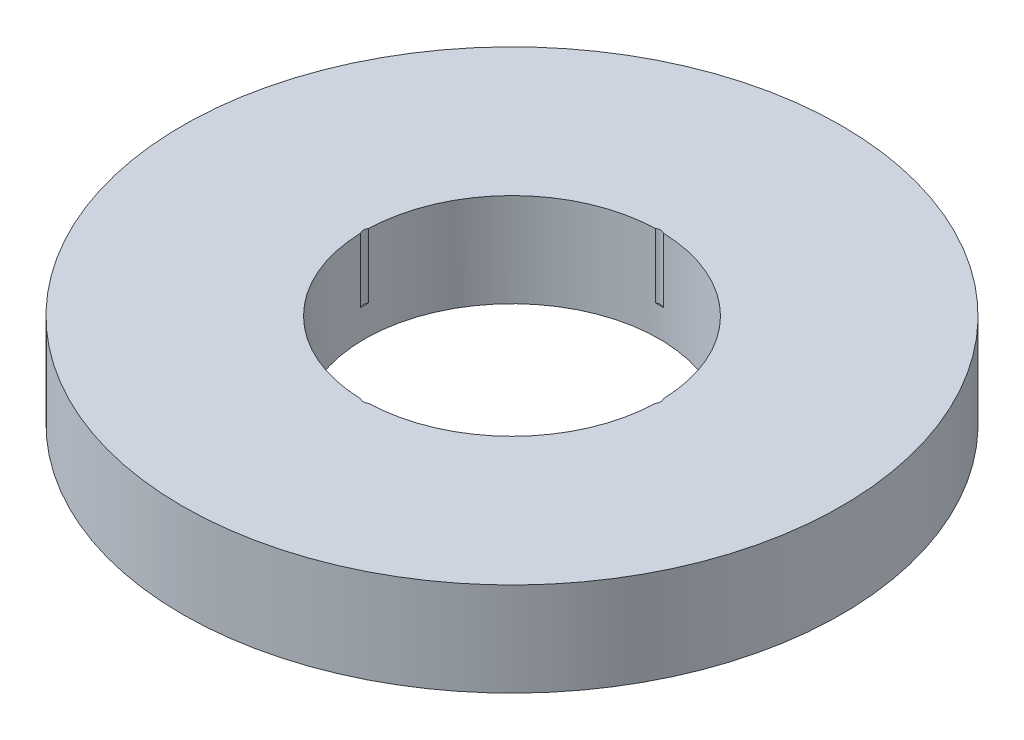
ISO-10303-21;
HEADER;
FILE_DESCRIPTION(('STEP AP214'),'2;1');
FILE_NAME('part.step','',(''),(''),'','','');
FILE_SCHEMA(('AUTOMOTIVE_DESIGN { 1 0 10303 214 1 1 1 1 }'));
ENDSEC;
DATA;
#1=APPLICATION_CONTEXT('core data for automotive mechanical design processes');
#2=APPLICATION_PROTOCOL_DEFINITION('international standard','automotive_design',2000,#1);
#3=PRODUCT_CONTEXT('',#1,'mechanical');
#4=PRODUCT('Part','Part','',(#3));
#5=PRODUCT_RELATED_PRODUCT_CATEGORY('part','',(#4));
#6=PRODUCT_DEFINITION_FORMATION('','',#4);
#7=PRODUCT_DEFINITION_CONTEXT('part definition',#1,'design');
#8=PRODUCT_DEFINITION('design','',#6,#7);
#9=PRODUCT_DEFINITION_SHAPE('','',#8);
#10=(LENGTH_UNIT() NAMED_UNIT(*) SI_UNIT(.MILLI.,.METRE.));
#11=(NAMED_UNIT(*) PLANE_ANGLE_UNIT() SI_UNIT($,.RADIAN.));
#12=(NAMED_UNIT(*) SI_UNIT($,.STERADIAN.) SOLID_ANGLE_UNIT());
#13=UNCERTAINTY_MEASURE_WITH_UNIT(LENGTH_MEASURE(1.E-05),#10,'distance_accuracy_value','');
#14=(GEOMETRIC_REPRESENTATION_CONTEXT(3) GLOBAL_UNCERTAINTY_ASSIGNED_CONTEXT((#13)) GLOBAL_UNIT_ASSIGNED_CONTEXT((#10,
#11,#12)) REPRESENTATION_CONTEXT('',''));
#15=CARTESIAN_POINT('',(0.,0.,0.));
#16=DIRECTION('',(0.,0.,1.));
#17=DIRECTION('',(1.,0.,0.));
#18=AXIS2_PLACEMENT_3D('',#15,#16,#17);
#19=CARTESIAN_POINT('',(0.,27.,0.));
#20=DIRECTION('',(0.,-1.,0.));
#21=DIRECTION('',(0.,0.,-1.));
#22=AXIS2_PLACEMENT_3D('',#19,#20,#21);
#23=CYLINDRICAL_SURFACE('',#22,95.);
#24=CARTESIAN_POINT('',(0.,27.,0.));
#25=DIRECTION('',(0.,1.,0.));
#26=DIRECTION('',(0.,0.,1.));
#27=AXIS2_PLACEMENT_3D('',#24,#25,#26);
#28=CIRCLE('',#27,95.);
#29=CARTESIAN_POINT('',(0.,27.,95.));
#30=VERTEX_POINT('',#29);
#31=EDGE_CURVE('E148',#30,#30,#28,.T.);
#32=ORIENTED_EDGE('',*,*,#31,.F.);
#33=EDGE_LOOP('',(#32));
#34=FACE_BOUND('',#33,.T.);
#35=CARTESIAN_POINT('',(0.,0.,0.));
#36=DIRECTION('',(0.,1.,0.));
#37=DIRECTION('',(0.,0.,1.));
#38=AXIS2_PLACEMENT_3D('',#35,#36,#37);
#39=CIRCLE('',#38,95.);
#40=CARTESIAN_POINT('',(0.,0.,95.));
#41=VERTEX_POINT('',#40);
#42=EDGE_CURVE('E139',#41,#41,#39,.T.);
#43=ORIENTED_EDGE('',*,*,#42,.T.);
#44=EDGE_LOOP('',(#43));
#45=FACE_BOUND('',#44,.T.);
#46=ADVANCED_FACE('F39',(#34,#45),#23,.T.);
#47=CARTESIAN_POINT('',(0.,27.,0.));
#48=DIRECTION('',(0.,1.,0.));
#49=DIRECTION('',(0.,0.,1.));
#50=AXIS2_PLACEMENT_3D('',#47,#48,#49);
#51=PLANE('',#50);
#52=CARTESIAN_POINT('',(1.42739840717847E-13,27.,40.882315231031));
#53=DIRECTION('',(0.,1.,0.));
#54=DIRECTION('',(1.,0.,0.));
#55=AXIS2_PLACEMENT_3D('',#52,#53,#54);
#56=CIRCLE('',#55,1.97356256777099);
#57=CARTESIAN_POINT('',(-1.15255031777323,27.,42.4843692169838));
#58=VERTEX_POINT('',#57);
#59=CARTESIAN_POINT('',(1.15255031777353,27.,42.4843692169838));
#60=VERTEX_POINT('',#59);
#61=EDGE_CURVE('E175',#58,#60,#56,.T.);
#62=ORIENTED_EDGE('',*,*,#61,.F.);
#63=CARTESIAN_POINT('',(0.,27.,0.));
#64=DIRECTION('',(0.,1.,0.));
#65=DIRECTION('',(0.,0.,1.));
#66=AXIS2_PLACEMENT_3D('',#63,#64,#65);
#67=CIRCLE('',#66,42.5);
#68=CARTESIAN_POINT('',(-42.4843692169838,27.,1.15255031777338));
#69=VERTEX_POINT('',#68);
#70=EDGE_CURVE('E134',#69,#58,#67,.T.);
#71=ORIENTED_EDGE('',*,*,#70,.F.);
#72=CARTESIAN_POINT('',(-40.882315231031,27.,0.));
#73=DIRECTION('',(0.,1.,0.));
#74=DIRECTION('',(0.,0.,1.));
#75=AXIS2_PLACEMENT_3D('',#72,#73,#74);
#76=CIRCLE('',#75,1.97356256777099);
#77=CARTESIAN_POINT('',(-42.4843692169838,27.,-1.15255031777338));
#78=VERTEX_POINT('',#77);
#79=EDGE_CURVE('E143',#78,#69,#76,.T.);
#80=ORIENTED_EDGE('',*,*,#79,.F.);
#81=CARTESIAN_POINT('',(-1.15255031777383,27.,-42.4843692169838));
#82=VERTEX_POINT('',#81);
#83=EDGE_CURVE('E123',#82,#78,#67,.T.);
#84=ORIENTED_EDGE('',*,*,#83,.F.);
#85=CARTESIAN_POINT('',(-4.28219522153541E-13,27.,-40.882315231031));
#86=DIRECTION('',(0.,1.,0.));
#87=DIRECTION('',(-1.,0.,0.));
#88=AXIS2_PLACEMENT_3D('',#85,#86,#87);
#89=CIRCLE('',#88,1.97356256777099);
#90=CARTESIAN_POINT('',(1.15255031777294,27.,-42.4843692169838));
#91=VERTEX_POINT('',#90);
#92=EDGE_CURVE('E106',#91,#82,#89,.T.);
#93=ORIENTED_EDGE('',*,*,#92,.F.);
#94=CARTESIAN_POINT('',(42.4843692169838,27.,-1.15255031777338));
#95=VERTEX_POINT('',#94);
#96=EDGE_CURVE('E125',#95,#91,#67,.T.);
#97=ORIENTED_EDGE('',*,*,#96,.F.);
#98=CARTESIAN_POINT('',(40.882315231031,27.,0.));
#99=DIRECTION('',(0.,1.,0.));
#100=DIRECTION('',(0.,0.,-1.));
#101=AXIS2_PLACEMENT_3D('',#98,#99,#100);
#102=CIRCLE('',#101,1.97356256777099);
#103=CARTESIAN_POINT('',(42.4843692169838,27.,1.15255031777338));
#104=VERTEX_POINT('',#103);
#105=EDGE_CURVE('E286',#104,#95,#102,.T.);
#106=ORIENTED_EDGE('',*,*,#105,.F.);
#107=EDGE_CURVE('E135',#60,#104,#67,.T.);
#108=ORIENTED_EDGE('',*,*,#107,.F.);
#109=EDGE_LOOP('',(#62,#71,#80,#84,#93,#97,#106,#108));
#110=FACE_BOUND('',#109,.T.);
#111=ORIENTED_EDGE('',*,*,#31,.T.);
#112=EDGE_LOOP('',(#111));
#113=FACE_BOUND('',#112,.T.);
#114=ADVANCED_FACE('F118',(#110,#113),#51,.T.);
#115=CARTESIAN_POINT('',(0.,0.,0.));
#116=DIRECTION('',(0.,1.,0.));
#117=DIRECTION('',(0.,0.,1.));
#118=AXIS2_PLACEMENT_3D('',#115,#116,#117);
#119=PLANE('',#118);
#120=CARTESIAN_POINT('',(0.,0.,0.));
#121=DIRECTION('',(0.,1.,0.));
#122=DIRECTION('',(0.,0.,1.));
#123=AXIS2_PLACEMENT_3D('',#120,#121,#122);
#124=CIRCLE('',#123,42.5);
#125=CARTESIAN_POINT('',(0.,0.,42.5));
#126=VERTEX_POINT('',#125);
#127=EDGE_CURVE('E136',#126,#126,#124,.T.);
#128=ORIENTED_EDGE('',*,*,#127,.T.);
#129=EDGE_LOOP('',(#128));
#130=FACE_BOUND('',#129,.T.);
#131=ORIENTED_EDGE('',*,*,#42,.F.);
#132=EDGE_LOOP('',(#131));
#133=FACE_BOUND('',#132,.T.);
#134=ADVANCED_FACE('F187',(#130,#133),#119,.F.);
#135=CARTESIAN_POINT('',(0.,27.,0.));
#136=DIRECTION('',(0.,-1.,0.));
#137=DIRECTION('',(0.,0.,-1.));
#138=AXIS2_PLACEMENT_3D('',#135,#136,#137);
#139=CYLINDRICAL_SURFACE('',#138,42.5);
#140=DIRECTION('',(0.,1.,0.));
#141=VECTOR('',#140,1.);
#142=CARTESIAN_POINT('',(-1.15255031777321,17.7057266501999,42.4843692169838));
#143=LINE('',#142,#141);
#144=CARTESIAN_POINT('',(-1.15255031777323,8.41145330039979,42.4843692169838));
#145=VERTEX_POINT('',#144);
#146=EDGE_CURVE('E11',#145,#58,#143,.T.);
#147=ORIENTED_EDGE('',*,*,#146,.F.);
#148=CARTESIAN_POINT('',(0.,8.41145330039979,0.));
#149=DIRECTION('',(0.,1.,0.));
#150=DIRECTION('',(0.,0.,1.));
#151=AXIS2_PLACEMENT_3D('',#148,#149,#150);
#152=CIRCLE('',#151,42.5);
#153=CARTESIAN_POINT('',(1.15255031777353,8.41145330039979,42.4843692169838));
#154=VERTEX_POINT('',#153);
#155=EDGE_CURVE('E170',#145,#154,#152,.T.);
#156=ORIENTED_EDGE('',*,*,#155,.T.);
#157=DIRECTION('',(0.,1.,0.));
#158=VECTOR('',#157,1.);
#159=CARTESIAN_POINT('',(1.1525503177735,17.7057266501999,42.4843692169838));
#160=LINE('',#159,#158);
#161=EDGE_CURVE('E46',#60,#154,#160,.F.);
#162=ORIENTED_EDGE('',*,*,#161,.F.);
#163=ORIENTED_EDGE('',*,*,#107,.T.);
#164=DIRECTION('',(0.,1.,0.));
#165=VECTOR('',#164,1.);
#166=CARTESIAN_POINT('',(42.4843692169838,17.7057266501999,1.15255031777335));
#167=LINE('',#166,#165);
#168=CARTESIAN_POINT('',(42.4843692169838,8.41145330039979,1.15255031777338));
#169=VERTEX_POINT('',#168);
#170=EDGE_CURVE('E164',#169,#104,#167,.T.);
#171=ORIENTED_EDGE('',*,*,#170,.F.);
#172=CARTESIAN_POINT('',(0.,8.41145330039979,0.));
#173=DIRECTION('',(0.,1.,0.));
#174=DIRECTION('',(0.,0.,1.));
#175=AXIS2_PLACEMENT_3D('',#172,#173,#174);
#176=CIRCLE('',#175,42.5);
#177=CARTESIAN_POINT('',(42.4843692169838,8.41145330039979,-1.15255031777338));
#178=VERTEX_POINT('',#177);
#179=EDGE_CURVE('E115',#169,#178,#176,.T.);
#180=ORIENTED_EDGE('',*,*,#179,.T.);
#181=DIRECTION('',(0.,1.,0.));
#182=VECTOR('',#181,1.);
#183=CARTESIAN_POINT('',(42.4843692169838,17.7057266501999,-1.15255031777335));
#184=LINE('',#183,#182);
#185=EDGE_CURVE('E131',#95,#178,#184,.F.);
#186=ORIENTED_EDGE('',*,*,#185,.F.);
#187=ORIENTED_EDGE('',*,*,#96,.T.);
#188=DIRECTION('',(0.,1.,0.));
#189=VECTOR('',#188,1.);
#190=CARTESIAN_POINT('',(1.15255031777291,17.7057266501999,-42.4843692169838));
#191=LINE('',#190,#189);
#192=CARTESIAN_POINT('',(1.15255031777294,8.41145330039979,-42.4843692169838));
#193=VERTEX_POINT('',#192);
#194=EDGE_CURVE('E105',#193,#91,#191,.T.);
#195=ORIENTED_EDGE('',*,*,#194,.F.);
#196=CARTESIAN_POINT('',(0.,8.41145330039979,0.));
#197=DIRECTION('',(0.,1.,0.));
#198=DIRECTION('',(0.,0.,1.));
#199=AXIS2_PLACEMENT_3D('',#196,#197,#198);
#200=CIRCLE('',#199,42.5);
#201=CARTESIAN_POINT('',(-1.15255031777383,8.41145330039979,-42.4843692169838));
#202=VERTEX_POINT('',#201);
#203=EDGE_CURVE('E159',#193,#202,#200,.T.);
#204=ORIENTED_EDGE('',*,*,#203,.T.);
#205=DIRECTION('',(0.,1.,0.));
#206=VECTOR('',#205,1.);
#207=CARTESIAN_POINT('',(-1.1525503177738,17.7057266501999,-42.4843692169838));
#208=LINE('',#207,#206);
#209=EDGE_CURVE('E114',#82,#202,#208,.F.);
#210=ORIENTED_EDGE('',*,*,#209,.F.);
#211=ORIENTED_EDGE('',*,*,#83,.T.);
#212=DIRECTION('',(0.,1.,0.));
#213=VECTOR('',#212,1.);
#214=CARTESIAN_POINT('',(-42.4843692169838,17.7057266501999,-1.15255031777335));
#215=LINE('',#214,#213);
#216=CARTESIAN_POINT('',(-42.4843692169838,8.41145330039979,-1.15255031777338));
#217=VERTEX_POINT('',#216);
#218=EDGE_CURVE('E160',#217,#78,#215,.T.);
#219=ORIENTED_EDGE('',*,*,#218,.F.);
#220=CARTESIAN_POINT('',(0.,8.41145330039979,0.));
#221=DIRECTION('',(0.,1.,0.));
#222=DIRECTION('',(0.,0.,1.));
#223=AXIS2_PLACEMENT_3D('',#220,#221,#222);
#224=CIRCLE('',#223,42.5);
#225=CARTESIAN_POINT('',(-42.4843692169838,8.41145330039979,1.15255031777338));
#226=VERTEX_POINT('',#225);
#227=EDGE_CURVE('E149',#217,#226,#224,.T.);
#228=ORIENTED_EDGE('',*,*,#227,.T.);
#229=DIRECTION('',(0.,1.,0.));
#230=VECTOR('',#229,1.);
#231=CARTESIAN_POINT('',(-42.4843692169838,17.7057266501999,1.15255031777335));
#232=LINE('',#231,#230);
#233=EDGE_CURVE('E152',#69,#226,#232,.F.);
#234=ORIENTED_EDGE('',*,*,#233,.F.);
#235=ORIENTED_EDGE('',*,*,#70,.T.);
#236=EDGE_LOOP('',(#147,#156,#162,#163,#171,#180,#186,#187,#195,#204,#210,#211,#219,#228,#234,#235));
#237=FACE_BOUND('',#236,.T.);
#238=ORIENTED_EDGE('',*,*,#127,.F.);
#239=EDGE_LOOP('',(#238));
#240=FACE_BOUND('',#239,.T.);
#241=ADVANCED_FACE('F126',(#237,#240),#139,.F.);
#242=CARTESIAN_POINT('',(-40.882315231031,8.41145330039979,0.));
#243=DIRECTION('',(0.,1.,0.));
#244=DIRECTION('',(0.,0.,1.));
#245=AXIS2_PLACEMENT_3D('',#242,#243,#244);
#246=CYLINDRICAL_SURFACE('',#245,1.97356256777099);
#247=ORIENTED_EDGE('',*,*,#218,.T.);
#248=ORIENTED_EDGE('',*,*,#79,.T.);
#249=ORIENTED_EDGE('',*,*,#233,.T.);
#250=CARTESIAN_POINT('',(-40.882315231031,8.41145330039979,0.));
#251=DIRECTION('',(0.,1.,0.));
#252=DIRECTION('',(0.,0.,1.));
#253=AXIS2_PLACEMENT_3D('',#250,#251,#252);
#254=CIRCLE('',#253,1.97356256777099);
#255=EDGE_CURVE('E144',#217,#226,#254,.T.);
#256=ORIENTED_EDGE('',*,*,#255,.F.);
#257=EDGE_LOOP('',(#247,#248,#249,#256));
#258=FACE_BOUND('',#257,.T.);
#259=ADVANCED_FACE('F200',(#258),#246,.F.);
#260=CARTESIAN_POINT('',(-40.882315231031,8.41145330039979,0.));
#261=DIRECTION('',(0.,1.,0.));
#262=DIRECTION('',(0.,0.,1.));
#263=AXIS2_PLACEMENT_3D('',#260,#261,#262);
#264=PLANE('',#263);
#265=ORIENTED_EDGE('',*,*,#255,.T.);
#266=ORIENTED_EDGE('',*,*,#227,.F.);
#267=EDGE_LOOP('',(#265,#266));
#268=FACE_BOUND('',#267,.T.);
#269=ADVANCED_FACE('F201',(#268),#264,.T.);
#270=CARTESIAN_POINT('',(-4.28219522153541E-13,8.41145330039979,-40.882315231031));
#271=DIRECTION('',(0.,1.,0.));
#272=DIRECTION('',(0.,0.,1.));
#273=AXIS2_PLACEMENT_3D('',#270,#271,#272);
#274=CYLINDRICAL_SURFACE('',#273,1.97356256777099);
#275=ORIENTED_EDGE('',*,*,#194,.T.);
#276=ORIENTED_EDGE('',*,*,#92,.T.);
#277=ORIENTED_EDGE('',*,*,#209,.T.);
#278=CARTESIAN_POINT('',(-4.28219522153541E-13,8.41145330039979,-40.882315231031));
#279=DIRECTION('',(0.,1.,0.));
#280=DIRECTION('',(-1.,0.,0.));
#281=AXIS2_PLACEMENT_3D('',#278,#279,#280);
#282=CIRCLE('',#281,1.97356256777099);
#283=EDGE_CURVE('E107',#193,#202,#282,.T.);
#284=ORIENTED_EDGE('',*,*,#283,.F.);
#285=EDGE_LOOP('',(#275,#276,#277,#284));
#286=FACE_BOUND('',#285,.T.);
#287=ADVANCED_FACE('F102',(#286),#274,.F.);
#288=CARTESIAN_POINT('',(-4.28219522153541E-13,8.41145330039979,-40.882315231031));
#289=DIRECTION('',(0.,1.,0.));
#290=DIRECTION('',(-1.,0.,0.));
#291=AXIS2_PLACEMENT_3D('',#288,#289,#290);
#292=PLANE('',#291);
#293=ORIENTED_EDGE('',*,*,#283,.T.);
#294=ORIENTED_EDGE('',*,*,#203,.F.);
#295=EDGE_LOOP('',(#293,#294));
#296=FACE_BOUND('',#295,.T.);
#297=ADVANCED_FACE('F209',(#296),#292,.T.);
#298=CARTESIAN_POINT('',(40.882315231031,8.41145330039979,0.));
#299=DIRECTION('',(0.,1.,0.));
#300=DIRECTION('',(0.,0.,1.));
#301=AXIS2_PLACEMENT_3D('',#298,#299,#300);
#302=CYLINDRICAL_SURFACE('',#301,1.97356256777099);
#303=ORIENTED_EDGE('',*,*,#170,.T.);
#304=ORIENTED_EDGE('',*,*,#105,.T.);
#305=ORIENTED_EDGE('',*,*,#185,.T.);
#306=CARTESIAN_POINT('',(40.882315231031,8.41145330039979,0.));
#307=DIRECTION('',(0.,1.,0.));
#308=DIRECTION('',(0.,0.,-1.));
#309=AXIS2_PLACEMENT_3D('',#306,#307,#308);
#310=CIRCLE('',#309,1.97356256777099);
#311=EDGE_CURVE('E56',#169,#178,#310,.T.);
#312=ORIENTED_EDGE('',*,*,#311,.F.);
#313=EDGE_LOOP('',(#303,#304,#305,#312));
#314=FACE_BOUND('',#313,.T.);
#315=ADVANCED_FACE('F213',(#314),#302,.F.);
#316=CARTESIAN_POINT('',(40.882315231031,8.41145330039979,0.));
#317=DIRECTION('',(0.,1.,0.));
#318=DIRECTION('',(0.,0.,-1.));
#319=AXIS2_PLACEMENT_3D('',#316,#317,#318);
#320=PLANE('',#319);
#321=ORIENTED_EDGE('',*,*,#311,.T.);
#322=ORIENTED_EDGE('',*,*,#179,.F.);
#323=EDGE_LOOP('',(#321,#322));
#324=FACE_BOUND('',#323,.T.);
#325=ADVANCED_FACE('F179',(#324),#320,.T.);
#326=CARTESIAN_POINT('',(1.42739840717847E-13,8.41145330039979,40.882315231031));
#327=DIRECTION('',(0.,1.,0.));
#328=DIRECTION('',(0.,0.,1.));
#329=AXIS2_PLACEMENT_3D('',#326,#327,#328);
#330=CYLINDRICAL_SURFACE('',#329,1.97356256777099);
#331=ORIENTED_EDGE('',*,*,#146,.T.);
#332=ORIENTED_EDGE('',*,*,#61,.T.);
#333=ORIENTED_EDGE('',*,*,#161,.T.);
#334=CARTESIAN_POINT('',(1.42739840717847E-13,8.41145330039979,40.882315231031));
#335=DIRECTION('',(0.,1.,0.));
#336=DIRECTION('',(1.,0.,0.));
#337=AXIS2_PLACEMENT_3D('',#334,#335,#336);
#338=CIRCLE('',#337,1.97356256777099);
#339=EDGE_CURVE('E55',#145,#154,#338,.T.);
#340=ORIENTED_EDGE('',*,*,#339,.F.);
#341=EDGE_LOOP('',(#331,#332,#333,#340));
#342=FACE_BOUND('',#341,.T.);
#343=ADVANCED_FACE('F171',(#342),#330,.F.);
#344=CARTESIAN_POINT('',(1.42739840717847E-13,8.41145330039979,40.882315231031));
#345=DIRECTION('',(0.,1.,0.));
#346=DIRECTION('',(1.,0.,0.));
#347=AXIS2_PLACEMENT_3D('',#344,#345,#346);
#348=PLANE('',#347);
#349=ORIENTED_EDGE('',*,*,#339,.T.);
#350=ORIENTED_EDGE('',*,*,#155,.F.);
#351=EDGE_LOOP('',(#349,#350));
#352=FACE_BOUND('',#351,.T.);
#353=ADVANCED_FACE('F173',(#352),#348,.T.);
#354=CLOSED_SHELL('',(#46,#114,#134,#241,#259,#269,#287,#297,#315,#325,#343,#353));
#355=MANIFOLD_SOLID_BREP('B2',#354);
#356=ADVANCED_BREP_SHAPE_REPRESENTATION('',(#18,#355),#14);
#357=SHAPE_DEFINITION_REPRESENTATION(#9,#356);
ENDSEC;
END-ISO-10303-21;
